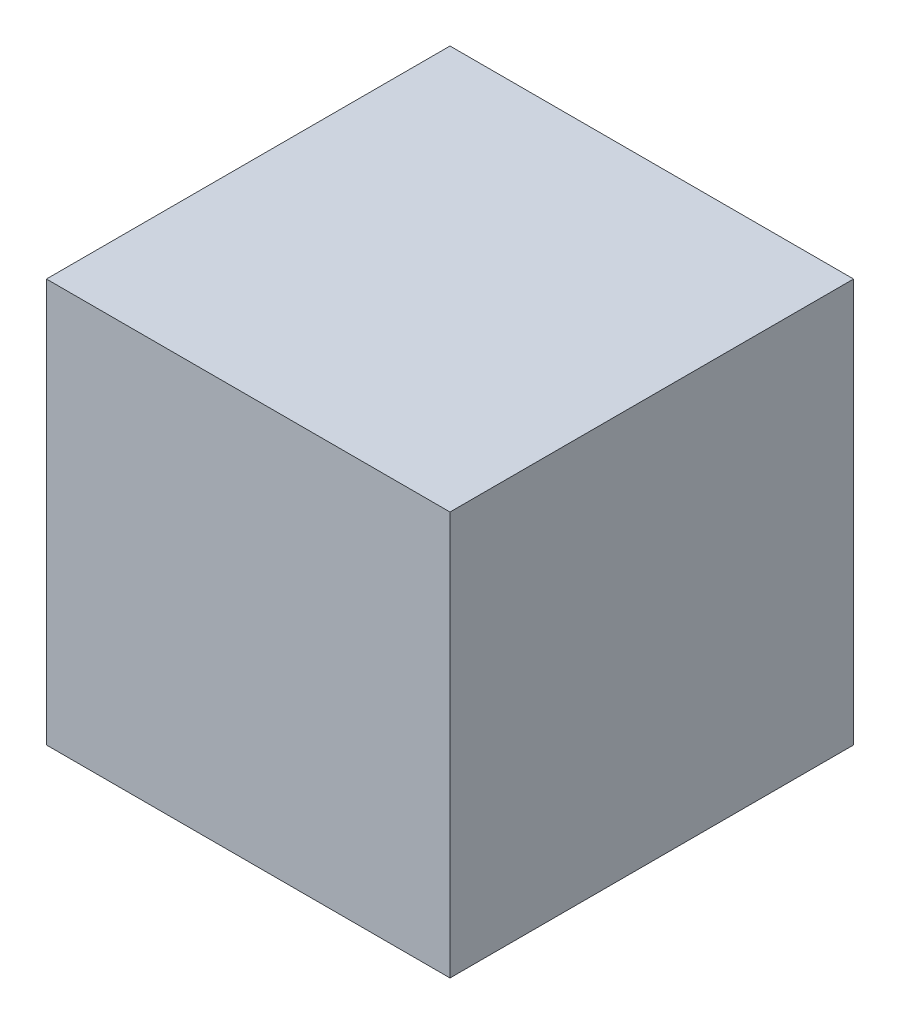
ISO-10303-21;
HEADER;
FILE_DESCRIPTION(('STEP AP214'),'2;1');
FILE_NAME('part.step','',(''),(''),'','','');
FILE_SCHEMA(('AUTOMOTIVE_DESIGN { 1 0 10303 214 1 1 1 1 }'));
ENDSEC;
DATA;
#1=APPLICATION_CONTEXT('core data for automotive mechanical design processes');
#2=APPLICATION_PROTOCOL_DEFINITION('international standard','automotive_design',2000,#1);
#3=PRODUCT_CONTEXT('',#1,'mechanical');
#4=PRODUCT('Part','Part','',(#3));
#5=PRODUCT_RELATED_PRODUCT_CATEGORY('part','',(#4));
#6=PRODUCT_DEFINITION_FORMATION('','',#4);
#7=PRODUCT_DEFINITION_CONTEXT('part definition',#1,'design');
#8=PRODUCT_DEFINITION('design','',#6,#7);
#9=PRODUCT_DEFINITION_SHAPE('','',#8);
#10=(LENGTH_UNIT() NAMED_UNIT(*) SI_UNIT(.MILLI.,.METRE.));
#11=(NAMED_UNIT(*) PLANE_ANGLE_UNIT() SI_UNIT($,.RADIAN.));
#12=(NAMED_UNIT(*) SI_UNIT($,.STERADIAN.) SOLID_ANGLE_UNIT());
#13=UNCERTAINTY_MEASURE_WITH_UNIT(LENGTH_MEASURE(1.E-05),#10,'distance_accuracy_value','');
#14=(GEOMETRIC_REPRESENTATION_CONTEXT(3) GLOBAL_UNCERTAINTY_ASSIGNED_CONTEXT((#13)) GLOBAL_UNIT_ASSIGNED_CONTEXT((#10,
#11,#12)) REPRESENTATION_CONTEXT('',''));
#15=CARTESIAN_POINT('',(0.,0.,0.));
#16=DIRECTION('',(0.,0.,1.));
#17=DIRECTION('',(1.,0.,0.));
#18=AXIS2_PLACEMENT_3D('',#15,#16,#17);
#19=CARTESIAN_POINT('',(50.,50.,50.));
#20=DIRECTION('',(-1.,0.,0.));
#21=DIRECTION('',(0.,-1.,0.));
#22=AXIS2_PLACEMENT_3D('',#19,#20,#21);
#23=PLANE('',#22);
#24=DIRECTION('',(0.,1.,0.));
#25=VECTOR('',#24,1.);
#26=CARTESIAN_POINT('',(50.,50.,-50.));
#27=LINE('',#26,#25);
#28=CARTESIAN_POINT('',(50.,-50.,-50.));
#29=VERTEX_POINT('',#28);
#30=CARTESIAN_POINT('',(50.,50.,-50.));
#31=VERTEX_POINT('',#30);
#32=EDGE_CURVE('E107',#29,#31,#27,.T.);
#33=ORIENTED_EDGE('',*,*,#32,.T.);
#34=DIRECTION('',(0.,0.,-1.));
#35=VECTOR('',#34,1.);
#36=CARTESIAN_POINT('',(50.,50.,50.));
#37=LINE('',#36,#35);
#38=CARTESIAN_POINT('',(50.,50.,50.));
#39=VERTEX_POINT('',#38);
#40=EDGE_CURVE('E11',#39,#31,#37,.T.);
#41=ORIENTED_EDGE('',*,*,#40,.F.);
#42=DIRECTION('',(0.,1.,0.));
#43=VECTOR('',#42,1.);
#44=CARTESIAN_POINT('',(50.,50.,50.));
#45=LINE('',#44,#43);
#46=CARTESIAN_POINT('',(50.,-50.,50.));
#47=VERTEX_POINT('',#46);
#48=EDGE_CURVE('E91',#47,#39,#45,.T.);
#49=ORIENTED_EDGE('',*,*,#48,.F.);
#50=DIRECTION('',(0.,0.,-1.));
#51=VECTOR('',#50,1.);
#52=CARTESIAN_POINT('',(50.,-50.,50.));
#53=LINE('',#52,#51);
#54=EDGE_CURVE('E103',#47,#29,#53,.T.);
#55=ORIENTED_EDGE('',*,*,#54,.T.);
#56=EDGE_LOOP('',(#33,#41,#49,#55));
#57=FACE_BOUND('',#56,.T.);
#58=ADVANCED_FACE('F39',(#57),#23,.F.);
#59=CARTESIAN_POINT('',(-50.,50.,50.));
#60=DIRECTION('',(0.,-1.,0.));
#61=DIRECTION('',(0.,0.,-1.));
#62=AXIS2_PLACEMENT_3D('',#59,#60,#61);
#63=PLANE('',#62);
#64=DIRECTION('',(-1.,0.,0.));
#65=VECTOR('',#64,1.);
#66=CARTESIAN_POINT('',(-50.,50.,-50.));
#67=LINE('',#66,#65);
#68=CARTESIAN_POINT('',(-50.,50.,-50.));
#69=VERTEX_POINT('',#68);
#70=EDGE_CURVE('E96',#31,#69,#67,.T.);
#71=ORIENTED_EDGE('',*,*,#70,.T.);
#72=DIRECTION('',(0.,0.,-1.));
#73=VECTOR('',#72,1.);
#74=CARTESIAN_POINT('',(-50.,50.,50.));
#75=LINE('',#74,#73);
#76=CARTESIAN_POINT('',(-50.,50.,50.));
#77=VERTEX_POINT('',#76);
#78=EDGE_CURVE('E48',#77,#69,#75,.T.);
#79=ORIENTED_EDGE('',*,*,#78,.F.);
#80=DIRECTION('',(-1.,0.,0.));
#81=VECTOR('',#80,1.);
#82=CARTESIAN_POINT('',(-50.,50.,50.));
#83=LINE('',#82,#81);
#84=EDGE_CURVE('E86',#39,#77,#83,.T.);
#85=ORIENTED_EDGE('',*,*,#84,.F.);
#86=ORIENTED_EDGE('',*,*,#40,.T.);
#87=EDGE_LOOP('',(#71,#79,#85,#86));
#88=FACE_BOUND('',#87,.T.);
#89=ADVANCED_FACE('F95',(#88),#63,.F.);
#90=CARTESIAN_POINT('',(-50.,50.,50.));
#91=DIRECTION('',(1.,0.,0.));
#92=DIRECTION('',(0.,1.,0.));
#93=AXIS2_PLACEMENT_3D('',#90,#91,#92);
#94=PLANE('',#93);
#95=DIRECTION('',(0.,-1.,0.));
#96=VECTOR('',#95,1.);
#97=CARTESIAN_POINT('',(-50.,50.,-50.));
#98=LINE('',#97,#96);
#99=CARTESIAN_POINT('',(-50.,-50.,-50.));
#100=VERTEX_POINT('',#99);
#101=EDGE_CURVE('E73',#69,#100,#98,.T.);
#102=ORIENTED_EDGE('',*,*,#101,.T.);
#103=DIRECTION('',(0.,0.,-1.));
#104=VECTOR('',#103,1.);
#105=CARTESIAN_POINT('',(-50.,-50.,50.));
#106=LINE('',#105,#104);
#107=CARTESIAN_POINT('',(-50.,-50.,50.));
#108=VERTEX_POINT('',#107);
#109=EDGE_CURVE('E98',#108,#100,#106,.T.);
#110=ORIENTED_EDGE('',*,*,#109,.F.);
#111=DIRECTION('',(0.,-1.,0.));
#112=VECTOR('',#111,1.);
#113=CARTESIAN_POINT('',(-50.,50.,50.));
#114=LINE('',#113,#112);
#115=EDGE_CURVE('E89',#77,#108,#114,.T.);
#116=ORIENTED_EDGE('',*,*,#115,.F.);
#117=ORIENTED_EDGE('',*,*,#78,.T.);
#118=EDGE_LOOP('',(#102,#110,#116,#117));
#119=FACE_BOUND('',#118,.T.);
#120=ADVANCED_FACE('F99',(#119),#94,.F.);
#121=CARTESIAN_POINT('',(-50.,-50.,50.));
#122=DIRECTION('',(0.,1.,0.));
#123=DIRECTION('',(0.,0.,1.));
#124=AXIS2_PLACEMENT_3D('',#121,#122,#123);
#125=PLANE('',#124);
#126=DIRECTION('',(1.,0.,0.));
#127=VECTOR('',#126,1.);
#128=CARTESIAN_POINT('',(-50.,-50.,-50.));
#129=LINE('',#128,#127);
#130=EDGE_CURVE('E79',#100,#29,#129,.T.);
#131=ORIENTED_EDGE('',*,*,#130,.T.);
#132=ORIENTED_EDGE('',*,*,#54,.F.);
#133=DIRECTION('',(1.,0.,0.));
#134=VECTOR('',#133,1.);
#135=CARTESIAN_POINT('',(-50.,-50.,50.));
#136=LINE('',#135,#134);
#137=EDGE_CURVE('E56',#108,#47,#136,.T.);
#138=ORIENTED_EDGE('',*,*,#137,.F.);
#139=ORIENTED_EDGE('',*,*,#109,.T.);
#140=EDGE_LOOP('',(#131,#132,#138,#139));
#141=FACE_BOUND('',#140,.T.);
#142=ADVANCED_FACE('F120',(#141),#125,.F.);
#143=CARTESIAN_POINT('',(0.,0.,50.));
#144=DIRECTION('',(0.,0.,1.));
#145=DIRECTION('',(1.,0.,0.));
#146=AXIS2_PLACEMENT_3D('',#143,#144,#145);
#147=PLANE('',#146);
#148=ORIENTED_EDGE('',*,*,#48,.T.);
#149=ORIENTED_EDGE('',*,*,#84,.T.);
#150=ORIENTED_EDGE('',*,*,#115,.T.);
#151=ORIENTED_EDGE('',*,*,#137,.T.);
#152=EDGE_LOOP('',(#148,#149,#150,#151));
#153=FACE_BOUND('',#152,.T.);
#154=ADVANCED_FACE('F87',(#153),#147,.T.);
#155=CARTESIAN_POINT('',(0.,0.,-50.));
#156=DIRECTION('',(0.,0.,1.));
#157=DIRECTION('',(1.,0.,0.));
#158=AXIS2_PLACEMENT_3D('',#155,#156,#157);
#159=PLANE('',#158);
#160=ORIENTED_EDGE('',*,*,#32,.F.);
#161=ORIENTED_EDGE('',*,*,#130,.F.);
#162=ORIENTED_EDGE('',*,*,#101,.F.);
#163=ORIENTED_EDGE('',*,*,#70,.F.);
#164=EDGE_LOOP('',(#160,#161,#162,#163));
#165=FACE_BOUND('',#164,.T.);
#166=ADVANCED_FACE('F123',(#165),#159,.F.);
#167=CLOSED_SHELL('',(#58,#89,#120,#142,#154,#166));
#168=MANIFOLD_SOLID_BREP('B2',#167);
#169=ADVANCED_BREP_SHAPE_REPRESENTATION('',(#18,#168),#14);
#170=SHAPE_DEFINITION_REPRESENTATION(#9,#169);
ENDSEC;
END-ISO-10303-21;
